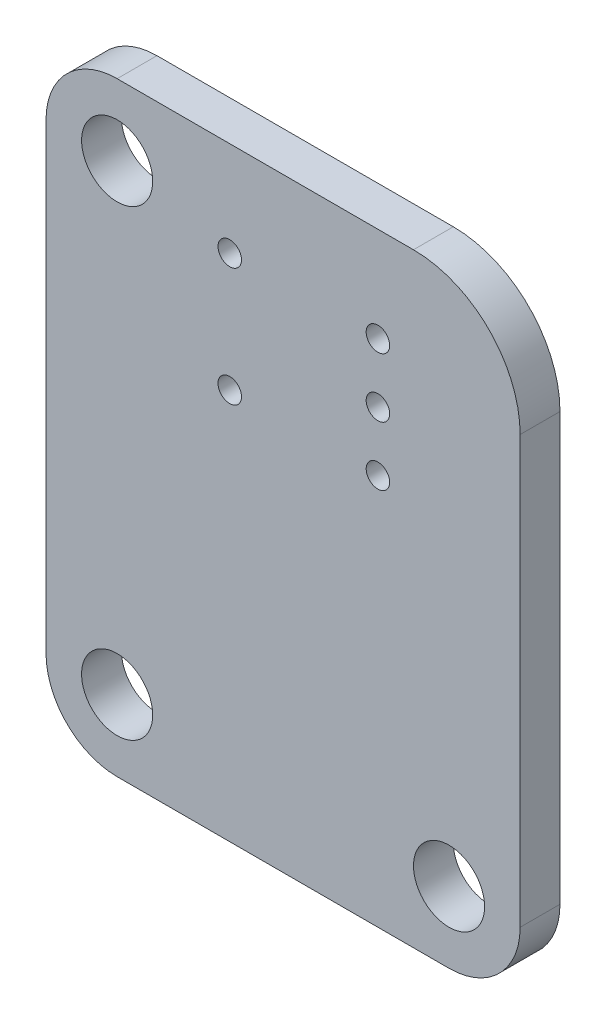
ISO-10303-21;
HEADER;
FILE_DESCRIPTION(('STEP AP214'),'2;1');
FILE_NAME('part.step','',(''),(''),'','','');
FILE_SCHEMA(('AUTOMOTIVE_DESIGN { 1 0 10303 214 1 1 1 1 }'));
ENDSEC;
DATA;
#1=APPLICATION_CONTEXT('core data for automotive mechanical design processes');
#2=APPLICATION_PROTOCOL_DEFINITION('international standard','automotive_design',2000,#1);
#3=PRODUCT_CONTEXT('',#1,'mechanical');
#4=PRODUCT('Part','Part','',(#3));
#5=PRODUCT_RELATED_PRODUCT_CATEGORY('part','',(#4));
#6=PRODUCT_DEFINITION_FORMATION('','',#4);
#7=PRODUCT_DEFINITION_CONTEXT('part definition',#1,'design');
#8=PRODUCT_DEFINITION('design','',#6,#7);
#9=PRODUCT_DEFINITION_SHAPE('','',#8);
#10=(LENGTH_UNIT() NAMED_UNIT(*) SI_UNIT(.MILLI.,.METRE.));
#11=(NAMED_UNIT(*) PLANE_ANGLE_UNIT() SI_UNIT($,.RADIAN.));
#12=(NAMED_UNIT(*) SI_UNIT($,.STERADIAN.) SOLID_ANGLE_UNIT());
#13=UNCERTAINTY_MEASURE_WITH_UNIT(LENGTH_MEASURE(1.E-05),#10,'distance_accuracy_value','');
#14=(GEOMETRIC_REPRESENTATION_CONTEXT(3) GLOBAL_UNCERTAINTY_ASSIGNED_CONTEXT((#13)) GLOBAL_UNIT_ASSIGNED_CONTEXT((#10,
#11,#12)) REPRESENTATION_CONTEXT('',''));
#15=CARTESIAN_POINT('',(0.,0.,0.));
#16=DIRECTION('',(0.,0.,1.));
#17=DIRECTION('',(1.,0.,0.));
#18=AXIS2_PLACEMENT_3D('',#15,#16,#17);
#19=CARTESIAN_POINT('',(95.5,60.5,-3.02000000000003));
#20=DIRECTION('',(0.,0.,-1.));
#21=DIRECTION('',(-1.,0.,0.));
#22=AXIS2_PLACEMENT_3D('',#19,#20,#21);
#23=CYLINDRICAL_SURFACE('',#22,4.50000000000003);
#24=CARTESIAN_POINT('',(95.5,60.5,-4.70000000000003));
#25=DIRECTION('',(0.,0.,1.));
#26=DIRECTION('',(1.,0.,0.));
#27=AXIS2_PLACEMENT_3D('',#24,#25,#26);
#28=CIRCLE('',#27,4.50000000000003);
#29=CARTESIAN_POINT('',(100.,60.5,-4.70000000000003));
#30=VERTEX_POINT('',#29);
#31=CARTESIAN_POINT('',(95.5,65.,-4.70000000000003));
#32=VERTEX_POINT('',#31);
#33=EDGE_CURVE('E130',#30,#32,#28,.T.);
#34=ORIENTED_EDGE('',*,*,#33,.T.);
#35=DIRECTION('',(0.,0.,-1.));
#36=VECTOR('',#35,1.);
#37=CARTESIAN_POINT('',(95.5,65.,-3.02000000000003));
#38=LINE('',#37,#36);
#39=CARTESIAN_POINT('',(95.5,65.,-3.02000000000003));
#40=VERTEX_POINT('',#39);
#41=EDGE_CURVE('E11',#40,#32,#38,.T.);
#42=ORIENTED_EDGE('',*,*,#41,.F.);
#43=CARTESIAN_POINT('',(95.5,60.5,-3.02000000000003));
#44=DIRECTION('',(0.,0.,1.));
#45=DIRECTION('',(1.,0.,0.));
#46=AXIS2_PLACEMENT_3D('',#43,#44,#45);
#47=CIRCLE('',#46,4.50000000000003);
#48=CARTESIAN_POINT('',(100.,60.5,-3.02000000000003));
#49=VERTEX_POINT('',#48);
#50=EDGE_CURVE('E145',#49,#40,#47,.T.);
#51=ORIENTED_EDGE('',*,*,#50,.F.);
#52=DIRECTION('',(0.,0.,-1.));
#53=VECTOR('',#52,1.);
#54=CARTESIAN_POINT('',(100.,60.5,-3.02000000000003));
#55=LINE('',#54,#53);
#56=EDGE_CURVE('E126',#49,#30,#55,.T.);
#57=ORIENTED_EDGE('',*,*,#56,.T.);
#58=EDGE_LOOP('',(#34,#42,#51,#57));
#59=FACE_BOUND('',#58,.T.);
#60=ADVANCED_FACE('F34',(#59),#23,.T.);
#61=CARTESIAN_POINT('',(95.5,65.,-3.02000000000003));
#62=DIRECTION('',(0.,-1.,0.));
#63=DIRECTION('',(1.,0.,0.));
#64=AXIS2_PLACEMENT_3D('',#61,#62,#63);
#65=PLANE('',#64);
#66=DIRECTION('',(-1.,0.,0.));
#67=VECTOR('',#66,1.);
#68=CARTESIAN_POINT('',(95.5,65.,-4.70000000000003));
#69=LINE('',#68,#67);
#70=CARTESIAN_POINT('',(83.,65.,-4.70000000000003));
#71=VERTEX_POINT('',#70);
#72=EDGE_CURVE('E133',#32,#71,#69,.T.);
#73=ORIENTED_EDGE('',*,*,#72,.T.);
#74=DIRECTION('',(0.,0.,-1.));
#75=VECTOR('',#74,1.);
#76=CARTESIAN_POINT('',(83.,65.,-3.02000000000003));
#77=LINE('',#76,#75);
#78=CARTESIAN_POINT('',(83.,65.,-3.02000000000003));
#79=VERTEX_POINT('',#78);
#80=EDGE_CURVE('E42',#79,#71,#77,.T.);
#81=ORIENTED_EDGE('',*,*,#80,.F.);
#82=DIRECTION('',(-1.,0.,0.));
#83=VECTOR('',#82,1.);
#84=CARTESIAN_POINT('',(95.5,65.,-3.02000000000003));
#85=LINE('',#84,#83);
#86=EDGE_CURVE('E93',#40,#79,#85,.T.);
#87=ORIENTED_EDGE('',*,*,#86,.F.);
#88=ORIENTED_EDGE('',*,*,#41,.T.);
#89=EDGE_LOOP('',(#73,#81,#87,#88));
#90=FACE_BOUND('',#89,.T.);
#91=ADVANCED_FACE('F240',(#90),#65,.F.);
#92=CARTESIAN_POINT('',(83.,62.,-3.02000000000003));
#93=DIRECTION('',(0.,0.,-1.));
#94=DIRECTION('',(-1.,0.,0.));
#95=AXIS2_PLACEMENT_3D('',#92,#93,#94);
#96=CYLINDRICAL_SURFACE('',#95,3.00000000000001);
#97=CARTESIAN_POINT('',(83.,62.,-4.70000000000003));
#98=DIRECTION('',(0.,0.,1.));
#99=DIRECTION('',(1.,0.,0.));
#100=AXIS2_PLACEMENT_3D('',#97,#98,#99);
#101=CIRCLE('',#100,3.00000000000001);
#102=CARTESIAN_POINT('',(80.,62.,-4.70000000000003));
#103=VERTEX_POINT('',#102);
#104=EDGE_CURVE('E136',#71,#103,#101,.T.);
#105=ORIENTED_EDGE('',*,*,#104,.T.);
#106=DIRECTION('',(0.,0.,-1.));
#107=VECTOR('',#106,1.);
#108=CARTESIAN_POINT('',(80.,62.,-3.02000000000003));
#109=LINE('',#108,#107);
#110=CARTESIAN_POINT('',(80.,62.,-3.02000000000003));
#111=VERTEX_POINT('',#110);
#112=EDGE_CURVE('E152',#111,#103,#109,.T.);
#113=ORIENTED_EDGE('',*,*,#112,.F.);
#114=CARTESIAN_POINT('',(83.,62.,-3.02000000000003));
#115=DIRECTION('',(0.,0.,1.));
#116=DIRECTION('',(1.,0.,0.));
#117=AXIS2_PLACEMENT_3D('',#114,#115,#116);
#118=CIRCLE('',#117,3.00000000000001);
#119=EDGE_CURVE('E160',#79,#111,#118,.T.);
#120=ORIENTED_EDGE('',*,*,#119,.F.);
#121=ORIENTED_EDGE('',*,*,#80,.T.);
#122=EDGE_LOOP('',(#105,#113,#120,#121));
#123=FACE_BOUND('',#122,.T.);
#124=ADVANCED_FACE('F158',(#123),#96,.T.);
#125=CARTESIAN_POINT('',(80.,42.5,-3.02000000000003));
#126=DIRECTION('',(1.,0.,0.));
#127=DIRECTION('',(0.,1.,0.));
#128=AXIS2_PLACEMENT_3D('',#125,#126,#127);
#129=PLANE('',#128);
#130=DIRECTION('',(0.,-1.,0.));
#131=VECTOR('',#130,1.);
#132=CARTESIAN_POINT('',(80.,42.5,-4.70000000000003));
#133=LINE('',#132,#131);
#134=CARTESIAN_POINT('',(80.,42.5,-4.70000000000003));
#135=VERTEX_POINT('',#134);
#136=EDGE_CURVE('E138',#103,#135,#133,.T.);
#137=ORIENTED_EDGE('',*,*,#136,.T.);
#138=DIRECTION('',(0.,0.,-1.));
#139=VECTOR('',#138,1.);
#140=CARTESIAN_POINT('',(80.,42.5,-3.02000000000003));
#141=LINE('',#140,#139);
#142=CARTESIAN_POINT('',(80.,42.5,-3.02000000000003));
#143=VERTEX_POINT('',#142);
#144=EDGE_CURVE('E149',#143,#135,#141,.T.);
#145=ORIENTED_EDGE('',*,*,#144,.F.);
#146=DIRECTION('',(0.,-1.,0.));
#147=VECTOR('',#146,1.);
#148=CARTESIAN_POINT('',(80.,42.5,-3.02000000000003));
#149=LINE('',#148,#147);
#150=EDGE_CURVE('E172',#111,#143,#149,.T.);
#151=ORIENTED_EDGE('',*,*,#150,.F.);
#152=ORIENTED_EDGE('',*,*,#112,.T.);
#153=EDGE_LOOP('',(#137,#145,#151,#152));
#154=FACE_BOUND('',#153,.T.);
#155=ADVANCED_FACE('F168',(#154),#129,.F.);
#156=CARTESIAN_POINT('',(83.,42.5,-3.02000000000003));
#157=DIRECTION('',(0.,0.,-1.));
#158=DIRECTION('',(-1.,0.,0.));
#159=AXIS2_PLACEMENT_3D('',#156,#157,#158);
#160=CYLINDRICAL_SURFACE('',#159,3.00000000000001);
#161=CARTESIAN_POINT('',(83.,42.5,-4.70000000000003));
#162=DIRECTION('',(0.,0.,1.));
#163=DIRECTION('',(-1.,0.,0.));
#164=AXIS2_PLACEMENT_3D('',#161,#162,#163);
#165=CIRCLE('',#164,3.00000000000001);
#166=CARTESIAN_POINT('',(83.,39.5,-4.70000000000003));
#167=VERTEX_POINT('',#166);
#168=EDGE_CURVE('E140',#135,#167,#165,.T.);
#169=ORIENTED_EDGE('',*,*,#168,.T.);
#170=DIRECTION('',(0.,0.,-1.));
#171=VECTOR('',#170,1.);
#172=CARTESIAN_POINT('',(83.,39.5,-3.02000000000003));
#173=LINE('',#172,#171);
#174=CARTESIAN_POINT('',(83.,39.5,-3.02000000000003));
#175=VERTEX_POINT('',#174);
#176=EDGE_CURVE('E121',#175,#167,#173,.T.);
#177=ORIENTED_EDGE('',*,*,#176,.F.);
#178=CARTESIAN_POINT('',(83.,42.5,-3.02000000000003));
#179=DIRECTION('',(0.,0.,1.));
#180=DIRECTION('',(-1.,0.,0.));
#181=AXIS2_PLACEMENT_3D('',#178,#179,#180);
#182=CIRCLE('',#181,3.00000000000001);
#183=EDGE_CURVE('E112',#143,#175,#182,.T.);
#184=ORIENTED_EDGE('',*,*,#183,.F.);
#185=ORIENTED_EDGE('',*,*,#144,.T.);
#186=EDGE_LOOP('',(#169,#177,#184,#185));
#187=FACE_BOUND('',#186,.T.);
#188=ADVANCED_FACE('F171',(#187),#160,.T.);
#189=CARTESIAN_POINT('',(97.,39.5,-3.02000000000003));
#190=DIRECTION('',(0.,1.,0.));
#191=DIRECTION('',(-1.,0.,0.));
#192=AXIS2_PLACEMENT_3D('',#189,#190,#191);
#193=PLANE('',#192);
#194=DIRECTION('',(1.,0.,0.));
#195=VECTOR('',#194,1.);
#196=CARTESIAN_POINT('',(97.,39.5,-4.70000000000003));
#197=LINE('',#196,#195);
#198=CARTESIAN_POINT('',(97.,39.5,-4.70000000000003));
#199=VERTEX_POINT('',#198);
#200=EDGE_CURVE('E120',#167,#199,#197,.T.);
#201=ORIENTED_EDGE('',*,*,#200,.T.);
#202=DIRECTION('',(0.,0.,-1.));
#203=VECTOR('',#202,1.);
#204=CARTESIAN_POINT('',(97.,39.5,-3.02000000000003));
#205=LINE('',#204,#203);
#206=CARTESIAN_POINT('',(97.,39.5,-3.02000000000003));
#207=VERTEX_POINT('',#206);
#208=EDGE_CURVE('E117',#207,#199,#205,.T.);
#209=ORIENTED_EDGE('',*,*,#208,.F.);
#210=DIRECTION('',(1.,0.,0.));
#211=VECTOR('',#210,1.);
#212=CARTESIAN_POINT('',(97.,39.5,-3.02000000000003));
#213=LINE('',#212,#211);
#214=EDGE_CURVE('E106',#175,#207,#213,.T.);
#215=ORIENTED_EDGE('',*,*,#214,.F.);
#216=ORIENTED_EDGE('',*,*,#176,.T.);
#217=EDGE_LOOP('',(#201,#209,#215,#216));
#218=FACE_BOUND('',#217,.T.);
#219=ADVANCED_FACE('F118',(#218),#193,.F.);
#220=CARTESIAN_POINT('',(97.,42.5,-3.02000000000003));
#221=DIRECTION('',(0.,0.,-1.));
#222=DIRECTION('',(-1.,0.,0.));
#223=AXIS2_PLACEMENT_3D('',#220,#221,#222);
#224=CYLINDRICAL_SURFACE('',#223,3.00000000000001);
#225=CARTESIAN_POINT('',(97.,42.5,-4.70000000000003));
#226=DIRECTION('',(0.,0.,1.));
#227=DIRECTION('',(1.,0.,0.));
#228=AXIS2_PLACEMENT_3D('',#225,#226,#227);
#229=CIRCLE('',#228,3.00000000000001);
#230=CARTESIAN_POINT('',(100.,42.5,-4.70000000000003));
#231=VERTEX_POINT('',#230);
#232=EDGE_CURVE('E79',#199,#231,#229,.T.);
#233=ORIENTED_EDGE('',*,*,#232,.T.);
#234=DIRECTION('',(0.,0.,-1.));
#235=VECTOR('',#234,1.);
#236=CARTESIAN_POINT('',(100.,42.5,-3.02000000000003));
#237=LINE('',#236,#235);
#238=CARTESIAN_POINT('',(100.,42.5,-3.02000000000003));
#239=VERTEX_POINT('',#238);
#240=EDGE_CURVE('E122',#239,#231,#237,.T.);
#241=ORIENTED_EDGE('',*,*,#240,.F.);
#242=CARTESIAN_POINT('',(97.,42.5,-3.02000000000003));
#243=DIRECTION('',(0.,0.,1.));
#244=DIRECTION('',(1.,0.,0.));
#245=AXIS2_PLACEMENT_3D('',#242,#243,#244);
#246=CIRCLE('',#245,3.00000000000001);
#247=EDGE_CURVE('E110',#207,#239,#246,.T.);
#248=ORIENTED_EDGE('',*,*,#247,.F.);
#249=ORIENTED_EDGE('',*,*,#208,.T.);
#250=EDGE_LOOP('',(#233,#241,#248,#249));
#251=FACE_BOUND('',#250,.T.);
#252=ADVANCED_FACE('F124',(#251),#224,.T.);
#253=CARTESIAN_POINT('',(100.,42.5,-3.02000000000003));
#254=DIRECTION('',(-1.,0.,0.));
#255=DIRECTION('',(0.,0.,1.));
#256=AXIS2_PLACEMENT_3D('',#253,#254,#255);
#257=PLANE('',#256);
#258=DIRECTION('',(0.,1.,0.));
#259=VECTOR('',#258,1.);
#260=CARTESIAN_POINT('',(100.,42.5,-4.70000000000003));
#261=LINE('',#260,#259);
#262=EDGE_CURVE('E85',#231,#30,#261,.T.);
#263=ORIENTED_EDGE('',*,*,#262,.T.);
#264=ORIENTED_EDGE('',*,*,#56,.F.);
#265=DIRECTION('',(0.,1.,0.));
#266=VECTOR('',#265,1.);
#267=CARTESIAN_POINT('',(100.,42.5,-3.02000000000003));
#268=LINE('',#267,#266);
#269=EDGE_CURVE('E50',#239,#49,#268,.T.);
#270=ORIENTED_EDGE('',*,*,#269,.F.);
#271=ORIENTED_EDGE('',*,*,#240,.T.);
#272=EDGE_LOOP('',(#263,#264,#270,#271));
#273=FACE_BOUND('',#272,.T.);
#274=ADVANCED_FACE('F247',(#273),#257,.F.);
#275=CARTESIAN_POINT('',(95.5,60.5,-3.02000000000003));
#276=DIRECTION('',(0.,0.,1.));
#277=DIRECTION('',(1.,0.,0.));
#278=AXIS2_PLACEMENT_3D('',#275,#276,#277);
#279=PLANE('',#278);
#280=CARTESIAN_POINT('',(94.0000000108,60.9999999962,-3.02000000000003));
#281=DIRECTION('',(0.,0.,1.));
#282=DIRECTION('',(1.,0.,0.));
#283=AXIS2_PLACEMENT_3D('',#280,#281,#282);
#284=CIRCLE('',#283,0.495300000000004);
#285=CARTESIAN_POINT('',(94.4953000108,60.9999999962,-3.02000000000003));
#286=VERTEX_POINT('',#285);
#287=EDGE_CURVE('E219',#286,#286,#284,.T.);
#288=ORIENTED_EDGE('',*,*,#287,.F.);
#289=EDGE_LOOP('',(#288));
#290=FACE_BOUND('',#289,.T.);
#291=CARTESIAN_POINT('',(94.0000000108,55.9999999886,-3.02000000000003));
#292=DIRECTION('',(0.,0.,1.));
#293=DIRECTION('',(1.,0.,0.));
#294=AXIS2_PLACEMENT_3D('',#291,#292,#293);
#295=CIRCLE('',#294,0.495300000000004);
#296=CARTESIAN_POINT('',(94.4953000108,55.9999999886,-3.02000000000003));
#297=VERTEX_POINT('',#296);
#298=EDGE_CURVE('E213',#297,#297,#295,.T.);
#299=ORIENTED_EDGE('',*,*,#298,.F.);
#300=EDGE_LOOP('',(#299));
#301=FACE_BOUND('',#300,.T.);
#302=CARTESIAN_POINT('',(94.0000000108,58.4999999924,-3.02000000000003));
#303=DIRECTION('',(0.,0.,1.));
#304=DIRECTION('',(1.,0.,0.));
#305=AXIS2_PLACEMENT_3D('',#302,#303,#304);
#306=CIRCLE('',#305,0.495300000000004);
#307=CARTESIAN_POINT('',(94.4953000108,58.4999999924,-3.02000000000003));
#308=VERTEX_POINT('',#307);
#309=EDGE_CURVE('E207',#308,#308,#306,.T.);
#310=ORIENTED_EDGE('',*,*,#309,.F.);
#311=EDGE_LOOP('',(#310));
#312=FACE_BOUND('',#311,.T.);
#313=CARTESIAN_POINT('',(87.7499999886,60.9999999962,-3.02000000000003));
#314=DIRECTION('',(0.,0.,1.));
#315=DIRECTION('',(1.,0.,0.));
#316=AXIS2_PLACEMENT_3D('',#313,#314,#315);
#317=CIRCLE('',#316,0.495300000000004);
#318=CARTESIAN_POINT('',(88.2452999886,60.9999999962,-3.02000000000003));
#319=VERTEX_POINT('',#318);
#320=EDGE_CURVE('E201',#319,#319,#317,.T.);
#321=ORIENTED_EDGE('',*,*,#320,.F.);
#322=EDGE_LOOP('',(#321));
#323=FACE_BOUND('',#322,.T.);
#324=CARTESIAN_POINT('',(87.7499999886,55.9999999886,-3.02000000000003));
#325=DIRECTION('',(0.,0.,1.));
#326=DIRECTION('',(1.,0.,0.));
#327=AXIS2_PLACEMENT_3D('',#324,#325,#326);
#328=CIRCLE('',#327,0.495300000000004);
#329=CARTESIAN_POINT('',(88.2452999886,55.9999999886,-3.02000000000003));
#330=VERTEX_POINT('',#329);
#331=EDGE_CURVE('E195',#330,#330,#328,.T.);
#332=ORIENTED_EDGE('',*,*,#331,.F.);
#333=EDGE_LOOP('',(#332));
#334=FACE_BOUND('',#333,.T.);
#335=CARTESIAN_POINT('',(83.,62.,-3.02000000000003));
#336=DIRECTION('',(0.,0.,1.));
#337=DIRECTION('',(1.,0.,0.));
#338=AXIS2_PLACEMENT_3D('',#335,#336,#337);
#339=CIRCLE('',#338,1.5);
#340=CARTESIAN_POINT('',(84.5,62.,-3.02000000000003));
#341=VERTEX_POINT('',#340);
#342=EDGE_CURVE('E189',#341,#341,#339,.T.);
#343=ORIENTED_EDGE('',*,*,#342,.F.);
#344=EDGE_LOOP('',(#343));
#345=FACE_BOUND('',#344,.T.);
#346=CARTESIAN_POINT('',(97.,42.5,-3.02000000000003));
#347=DIRECTION('',(0.,0.,1.));
#348=DIRECTION('',(1.,0.,0.));
#349=AXIS2_PLACEMENT_3D('',#346,#347,#348);
#350=CIRCLE('',#349,1.5);
#351=CARTESIAN_POINT('',(98.5,42.5,-3.02000000000003));
#352=VERTEX_POINT('',#351);
#353=EDGE_CURVE('E183',#352,#352,#350,.T.);
#354=ORIENTED_EDGE('',*,*,#353,.F.);
#355=EDGE_LOOP('',(#354));
#356=FACE_BOUND('',#355,.T.);
#357=CARTESIAN_POINT('',(83.,42.5,-3.02000000000003));
#358=DIRECTION('',(0.,0.,1.));
#359=DIRECTION('',(1.,0.,0.));
#360=AXIS2_PLACEMENT_3D('',#357,#358,#359);
#361=CIRCLE('',#360,1.5);
#362=CARTESIAN_POINT('',(84.5,42.5,-3.02000000000003));
#363=VERTEX_POINT('',#362);
#364=EDGE_CURVE('E134',#363,#363,#361,.T.);
#365=ORIENTED_EDGE('',*,*,#364,.F.);
#366=EDGE_LOOP('',(#365));
#367=FACE_BOUND('',#366,.T.);
#368=ORIENTED_EDGE('',*,*,#50,.T.);
#369=ORIENTED_EDGE('',*,*,#86,.T.);
#370=ORIENTED_EDGE('',*,*,#119,.T.);
#371=ORIENTED_EDGE('',*,*,#150,.T.);
#372=ORIENTED_EDGE('',*,*,#183,.T.);
#373=ORIENTED_EDGE('',*,*,#214,.T.);
#374=ORIENTED_EDGE('',*,*,#247,.T.);
#375=ORIENTED_EDGE('',*,*,#269,.T.);
#376=EDGE_LOOP('',(#368,#369,#370,#371,#372,#373,#374,#375));
#377=FACE_BOUND('',#376,.T.);
#378=ADVANCED_FACE('F108',(#290,#301,#312,#323,#334,#345,#356,#367,#377),#279,.T.);
#379=CARTESIAN_POINT('',(95.5,60.5,-4.70000000000003));
#380=DIRECTION('',(0.,0.,1.));
#381=DIRECTION('',(1.,0.,0.));
#382=AXIS2_PLACEMENT_3D('',#379,#380,#381);
#383=PLANE('',#382);
#384=CARTESIAN_POINT('',(94.0000000108,60.9999999962,-4.70000000000003));
#385=DIRECTION('',(0.,0.,1.));
#386=DIRECTION('',(1.,0.,0.));
#387=AXIS2_PLACEMENT_3D('',#384,#385,#386);
#388=CIRCLE('',#387,0.495300000000004);
#389=CARTESIAN_POINT('',(94.4953000108,60.9999999962,-4.70000000000003));
#390=VERTEX_POINT('',#389);
#391=EDGE_CURVE('E222',#390,#390,#388,.T.);
#392=ORIENTED_EDGE('',*,*,#391,.T.);
#393=EDGE_LOOP('',(#392));
#394=FACE_BOUND('',#393,.T.);
#395=CARTESIAN_POINT('',(94.0000000108,55.9999999886,-4.70000000000003));
#396=DIRECTION('',(0.,0.,1.));
#397=DIRECTION('',(1.,0.,0.));
#398=AXIS2_PLACEMENT_3D('',#395,#396,#397);
#399=CIRCLE('',#398,0.495300000000004);
#400=CARTESIAN_POINT('',(94.4953000108,55.9999999886,-4.70000000000003));
#401=VERTEX_POINT('',#400);
#402=EDGE_CURVE('E216',#401,#401,#399,.T.);
#403=ORIENTED_EDGE('',*,*,#402,.T.);
#404=EDGE_LOOP('',(#403));
#405=FACE_BOUND('',#404,.T.);
#406=CARTESIAN_POINT('',(94.0000000108,58.4999999924,-4.70000000000003));
#407=DIRECTION('',(0.,0.,1.));
#408=DIRECTION('',(1.,0.,0.));
#409=AXIS2_PLACEMENT_3D('',#406,#407,#408);
#410=CIRCLE('',#409,0.495300000000004);
#411=CARTESIAN_POINT('',(94.4953000108,58.4999999924,-4.70000000000003));
#412=VERTEX_POINT('',#411);
#413=EDGE_CURVE('E210',#412,#412,#410,.T.);
#414=ORIENTED_EDGE('',*,*,#413,.T.);
#415=EDGE_LOOP('',(#414));
#416=FACE_BOUND('',#415,.T.);
#417=CARTESIAN_POINT('',(87.7499999886,60.9999999962,-4.70000000000003));
#418=DIRECTION('',(0.,0.,1.));
#419=DIRECTION('',(1.,0.,0.));
#420=AXIS2_PLACEMENT_3D('',#417,#418,#419);
#421=CIRCLE('',#420,0.495300000000004);
#422=CARTESIAN_POINT('',(88.2452999886,60.9999999962,-4.70000000000003));
#423=VERTEX_POINT('',#422);
#424=EDGE_CURVE('E204',#423,#423,#421,.T.);
#425=ORIENTED_EDGE('',*,*,#424,.T.);
#426=EDGE_LOOP('',(#425));
#427=FACE_BOUND('',#426,.T.);
#428=CARTESIAN_POINT('',(87.7499999886,55.9999999886,-4.70000000000003));
#429=DIRECTION('',(0.,0.,1.));
#430=DIRECTION('',(1.,0.,0.));
#431=AXIS2_PLACEMENT_3D('',#428,#429,#430);
#432=CIRCLE('',#431,0.495300000000004);
#433=CARTESIAN_POINT('',(88.2452999886,55.9999999886,-4.70000000000003));
#434=VERTEX_POINT('',#433);
#435=EDGE_CURVE('E198',#434,#434,#432,.T.);
#436=ORIENTED_EDGE('',*,*,#435,.T.);
#437=EDGE_LOOP('',(#436));
#438=FACE_BOUND('',#437,.T.);
#439=CARTESIAN_POINT('',(83.,62.,-4.70000000000003));
#440=DIRECTION('',(0.,0.,1.));
#441=DIRECTION('',(1.,0.,0.));
#442=AXIS2_PLACEMENT_3D('',#439,#440,#441);
#443=CIRCLE('',#442,1.5);
#444=CARTESIAN_POINT('',(84.5,62.,-4.70000000000003));
#445=VERTEX_POINT('',#444);
#446=EDGE_CURVE('E192',#445,#445,#443,.T.);
#447=ORIENTED_EDGE('',*,*,#446,.T.);
#448=EDGE_LOOP('',(#447));
#449=FACE_BOUND('',#448,.T.);
#450=CARTESIAN_POINT('',(97.,42.5,-4.70000000000003));
#451=DIRECTION('',(0.,0.,1.));
#452=DIRECTION('',(1.,0.,0.));
#453=AXIS2_PLACEMENT_3D('',#450,#451,#452);
#454=CIRCLE('',#453,1.5);
#455=CARTESIAN_POINT('',(98.5,42.5,-4.70000000000003));
#456=VERTEX_POINT('',#455);
#457=EDGE_CURVE('E186',#456,#456,#454,.T.);
#458=ORIENTED_EDGE('',*,*,#457,.T.);
#459=EDGE_LOOP('',(#458));
#460=FACE_BOUND('',#459,.T.);
#461=CARTESIAN_POINT('',(83.,42.5,-4.70000000000003));
#462=DIRECTION('',(0.,0.,1.));
#463=DIRECTION('',(1.,0.,0.));
#464=AXIS2_PLACEMENT_3D('',#461,#462,#463);
#465=CIRCLE('',#464,1.5);
#466=CARTESIAN_POINT('',(84.5,42.5,-4.70000000000003));
#467=VERTEX_POINT('',#466);
#468=EDGE_CURVE('E180',#467,#467,#465,.T.);
#469=ORIENTED_EDGE('',*,*,#468,.T.);
#470=EDGE_LOOP('',(#469));
#471=FACE_BOUND('',#470,.T.);
#472=ORIENTED_EDGE('',*,*,#33,.F.);
#473=ORIENTED_EDGE('',*,*,#262,.F.);
#474=ORIENTED_EDGE('',*,*,#232,.F.);
#475=ORIENTED_EDGE('',*,*,#200,.F.);
#476=ORIENTED_EDGE('',*,*,#168,.F.);
#477=ORIENTED_EDGE('',*,*,#136,.F.);
#478=ORIENTED_EDGE('',*,*,#104,.F.);
#479=ORIENTED_EDGE('',*,*,#72,.F.);
#480=EDGE_LOOP('',(#472,#473,#474,#475,#476,#477,#478,#479));
#481=FACE_BOUND('',#480,.T.);
#482=ADVANCED_FACE('F164',(#394,#405,#416,#427,#438,#449,#460,#471,#481),#383,.F.);
#483=CARTESIAN_POINT('',(83.,42.5,-4.70000000000003));
#484=DIRECTION('',(0.,0.,1.));
#485=DIRECTION('',(1.,0.,0.));
#486=AXIS2_PLACEMENT_3D('',#483,#484,#485);
#487=CYLINDRICAL_SURFACE('',#486,1.5);
#488=ORIENTED_EDGE('',*,*,#364,.T.);
#489=EDGE_LOOP('',(#488));
#490=FACE_BOUND('',#489,.T.);
#491=ORIENTED_EDGE('',*,*,#468,.F.);
#492=EDGE_LOOP('',(#491));
#493=FACE_BOUND('',#492,.T.);
#494=ADVANCED_FACE('F305',(#490,#493),#487,.F.);
#495=CARTESIAN_POINT('',(97.,42.5,-4.70000000000003));
#496=DIRECTION('',(0.,0.,1.));
#497=DIRECTION('',(1.,0.,0.));
#498=AXIS2_PLACEMENT_3D('',#495,#496,#497);
#499=CYLINDRICAL_SURFACE('',#498,1.5);
#500=ORIENTED_EDGE('',*,*,#353,.T.);
#501=EDGE_LOOP('',(#500));
#502=FACE_BOUND('',#501,.T.);
#503=ORIENTED_EDGE('',*,*,#457,.F.);
#504=EDGE_LOOP('',(#503));
#505=FACE_BOUND('',#504,.T.);
#506=ADVANCED_FACE('F313',(#502,#505),#499,.F.);
#507=CARTESIAN_POINT('',(83.,62.,-4.70000000000003));
#508=DIRECTION('',(0.,0.,1.));
#509=DIRECTION('',(1.,0.,0.));
#510=AXIS2_PLACEMENT_3D('',#507,#508,#509);
#511=CYLINDRICAL_SURFACE('',#510,1.5);
#512=ORIENTED_EDGE('',*,*,#342,.T.);
#513=EDGE_LOOP('',(#512));
#514=FACE_BOUND('',#513,.T.);
#515=ORIENTED_EDGE('',*,*,#446,.F.);
#516=EDGE_LOOP('',(#515));
#517=FACE_BOUND('',#516,.T.);
#518=ADVANCED_FACE('F323',(#514,#517),#511,.F.);
#519=CARTESIAN_POINT('',(87.7499999886,55.9999999886,-4.70000000000003));
#520=DIRECTION('',(0.,0.,1.));
#521=DIRECTION('',(1.,0.,0.));
#522=AXIS2_PLACEMENT_3D('',#519,#520,#521);
#523=CYLINDRICAL_SURFACE('',#522,0.495300000000004);
#524=ORIENTED_EDGE('',*,*,#331,.T.);
#525=EDGE_LOOP('',(#524));
#526=FACE_BOUND('',#525,.T.);
#527=ORIENTED_EDGE('',*,*,#435,.F.);
#528=EDGE_LOOP('',(#527));
#529=FACE_BOUND('',#528,.T.);
#530=ADVANCED_FACE('F333',(#526,#529),#523,.F.);
#531=CARTESIAN_POINT('',(87.7499999886,60.9999999962,-4.70000000000003));
#532=DIRECTION('',(0.,0.,1.));
#533=DIRECTION('',(1.,0.,0.));
#534=AXIS2_PLACEMENT_3D('',#531,#532,#533);
#535=CYLINDRICAL_SURFACE('',#534,0.495300000000004);
#536=ORIENTED_EDGE('',*,*,#320,.T.);
#537=EDGE_LOOP('',(#536));
#538=FACE_BOUND('',#537,.T.);
#539=ORIENTED_EDGE('',*,*,#424,.F.);
#540=EDGE_LOOP('',(#539));
#541=FACE_BOUND('',#540,.T.);
#542=ADVANCED_FACE('F343',(#538,#541),#535,.F.);
#543=CARTESIAN_POINT('',(94.0000000108,58.4999999924,-4.70000000000003));
#544=DIRECTION('',(0.,0.,1.));
#545=DIRECTION('',(1.,0.,0.));
#546=AXIS2_PLACEMENT_3D('',#543,#544,#545);
#547=CYLINDRICAL_SURFACE('',#546,0.495300000000004);
#548=ORIENTED_EDGE('',*,*,#309,.T.);
#549=EDGE_LOOP('',(#548));
#550=FACE_BOUND('',#549,.T.);
#551=ORIENTED_EDGE('',*,*,#413,.F.);
#552=EDGE_LOOP('',(#551));
#553=FACE_BOUND('',#552,.T.);
#554=ADVANCED_FACE('F236',(#550,#553),#547,.F.);
#555=CARTESIAN_POINT('',(94.0000000108,55.9999999886,-4.70000000000003));
#556=DIRECTION('',(0.,0.,1.));
#557=DIRECTION('',(1.,0.,0.));
#558=AXIS2_PLACEMENT_3D('',#555,#556,#557);
#559=CYLINDRICAL_SURFACE('',#558,0.495300000000004);
#560=ORIENTED_EDGE('',*,*,#298,.T.);
#561=EDGE_LOOP('',(#560));
#562=FACE_BOUND('',#561,.T.);
#563=ORIENTED_EDGE('',*,*,#402,.F.);
#564=EDGE_LOOP('',(#563));
#565=FACE_BOUND('',#564,.T.);
#566=ADVANCED_FACE('F230',(#562,#565),#559,.F.);
#567=CARTESIAN_POINT('',(94.0000000108,60.9999999962,-4.70000000000003));
#568=DIRECTION('',(0.,0.,1.));
#569=DIRECTION('',(1.,0.,0.));
#570=AXIS2_PLACEMENT_3D('',#567,#568,#569);
#571=CYLINDRICAL_SURFACE('',#570,0.495300000000004);
#572=ORIENTED_EDGE('',*,*,#287,.T.);
#573=EDGE_LOOP('',(#572));
#574=FACE_BOUND('',#573,.T.);
#575=ORIENTED_EDGE('',*,*,#391,.F.);
#576=EDGE_LOOP('',(#575));
#577=FACE_BOUND('',#576,.T.);
#578=ADVANCED_FACE('F228',(#574,#577),#571,.F.);
#579=CLOSED_SHELL('',(#60,#91,#124,#155,#188,#219,#252,#274,#378,#482,#494,#506,#518,#530,#542,
#554,#566,#578));
#580=MANIFOLD_SOLID_BREP('B2',#579);
#581=ADVANCED_BREP_SHAPE_REPRESENTATION('',(#18,#580),#14);
#582=SHAPE_DEFINITION_REPRESENTATION(#9,#581);
ENDSEC;
END-ISO-10303-21;
